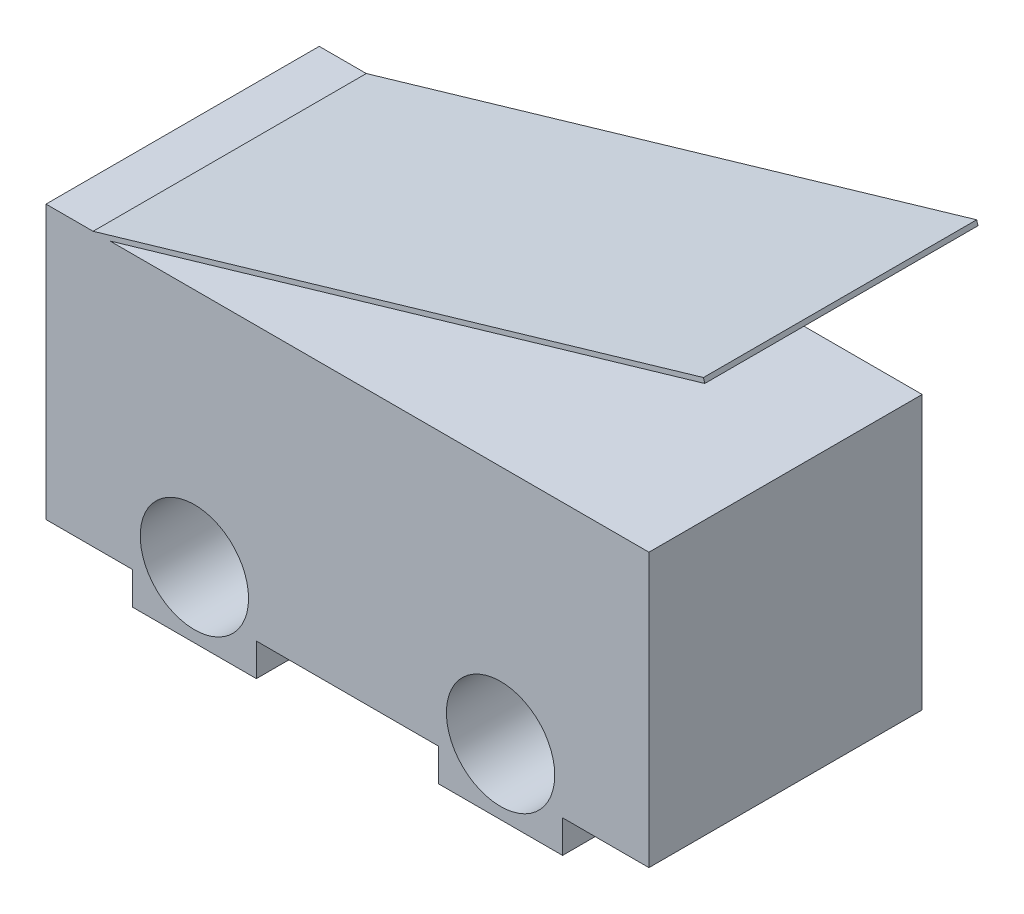
ISO-10303-21;
HEADER;
FILE_DESCRIPTION(('STEP AP214'),'2;1');
FILE_NAME('part.step','',(''),(''),'','','');
FILE_SCHEMA(('AUTOMOTIVE_DESIGN { 1 0 10303 214 1 1 1 1 }'));
ENDSEC;
DATA;
#1=APPLICATION_CONTEXT('core data for automotive mechanical design processes');
#2=APPLICATION_PROTOCOL_DEFINITION('international standard','automotive_design',2000,#1);
#3=PRODUCT_CONTEXT('',#1,'mechanical');
#4=PRODUCT('Part','Part','',(#3));
#5=PRODUCT_RELATED_PRODUCT_CATEGORY('part','',(#4));
#6=PRODUCT_DEFINITION_FORMATION('','',#4);
#7=PRODUCT_DEFINITION_CONTEXT('part definition',#1,'design');
#8=PRODUCT_DEFINITION('design','',#6,#7);
#9=PRODUCT_DEFINITION_SHAPE('','',#8);
#10=(LENGTH_UNIT() NAMED_UNIT(*) SI_UNIT(.MILLI.,.METRE.));
#11=(NAMED_UNIT(*) PLANE_ANGLE_UNIT() SI_UNIT($,.RADIAN.));
#12=(NAMED_UNIT(*) SI_UNIT($,.STERADIAN.) SOLID_ANGLE_UNIT());
#13=UNCERTAINTY_MEASURE_WITH_UNIT(LENGTH_MEASURE(1.E-05),#10,'distance_accuracy_value','');
#14=(GEOMETRIC_REPRESENTATION_CONTEXT(3) GLOBAL_UNCERTAINTY_ASSIGNED_CONTEXT((#13)) GLOBAL_UNIT_ASSIGNED_CONTEXT((#10,
#11,#12)) REPRESENTATION_CONTEXT('',''));
#15=CARTESIAN_POINT('',(0.,0.,0.));
#16=DIRECTION('',(0.,0.,1.));
#17=DIRECTION('',(1.,0.,0.));
#18=AXIS2_PLACEMENT_3D('',#15,#16,#17);
#19=CARTESIAN_POINT('',(6.4,2.9,-5.8));
#20=DIRECTION('',(0.,1.,0.));
#21=DIRECTION('',(-1.,0.,0.));
#22=AXIS2_PLACEMENT_3D('',#19,#20,#21);
#23=PLANE('',#22);
#24=DIRECTION('',(-1.,0.,0.));
#25=VECTOR('',#24,1.);
#26=CARTESIAN_POINT('',(6.4,2.9,0.));
#27=LINE('',#26,#25);
#28=CARTESIAN_POINT('',(-5.4,2.9,0.));
#29=VERTEX_POINT('',#28);
#30=CARTESIAN_POINT('',(-6.4,2.9,0.));
#31=VERTEX_POINT('',#30);
#32=EDGE_CURVE('E64',#29,#31,#27,.T.);
#33=ORIENTED_EDGE('',*,*,#32,.F.);
#34=DIRECTION('',(0.,0.,1.));
#35=VECTOR('',#34,1.);
#36=CARTESIAN_POINT('',(-5.4,2.9,-19.3541518362062));
#37=LINE('',#36,#35);
#38=CARTESIAN_POINT('',(-5.4,2.9,-5.8));
#39=VERTEX_POINT('',#38);
#40=EDGE_CURVE('E190',#39,#29,#37,.T.);
#41=ORIENTED_EDGE('',*,*,#40,.F.);
#42=DIRECTION('',(-1.,0.,0.));
#43=VECTOR('',#42,1.);
#44=CARTESIAN_POINT('',(6.4,2.9,-5.8));
#45=LINE('',#44,#43);
#46=CARTESIAN_POINT('',(-6.4,2.9,-5.8));
#47=VERTEX_POINT('',#46);
#48=EDGE_CURVE('E263',#39,#47,#45,.T.);
#49=ORIENTED_EDGE('',*,*,#48,.T.);
#50=DIRECTION('',(0.,0.,1.));
#51=VECTOR('',#50,1.);
#52=CARTESIAN_POINT('',(-6.4,2.9,-5.8));
#53=LINE('',#52,#51);
#54=EDGE_CURVE('E11',#47,#31,#53,.T.);
#55=ORIENTED_EDGE('',*,*,#54,.T.);
#56=EDGE_LOOP('',(#33,#41,#49,#55));
#57=FACE_BOUND('',#56,.T.);
#58=ADVANCED_FACE('F39',(#57),#23,.T.);
#59=CARTESIAN_POINT('',(-6.4,-2.9,-5.8));
#60=DIRECTION('',(-1.,0.,0.));
#61=DIRECTION('',(0.,0.,1.));
#62=AXIS2_PLACEMENT_3D('',#59,#60,#61);
#63=PLANE('',#62);
#64=DIRECTION('',(0.,-1.,0.));
#65=VECTOR('',#64,1.);
#66=CARTESIAN_POINT('',(-6.4,-2.9,0.));
#67=LINE('',#66,#65);
#68=CARTESIAN_POINT('',(-6.4,-2.9,0.));
#69=VERTEX_POINT('',#68);
#70=EDGE_CURVE('E215',#31,#69,#67,.T.);
#71=ORIENTED_EDGE('',*,*,#70,.F.);
#72=ORIENTED_EDGE('',*,*,#54,.F.);
#73=DIRECTION('',(0.,-1.,0.));
#74=VECTOR('',#73,1.);
#75=CARTESIAN_POINT('',(-6.4,-2.9,-5.8));
#76=LINE('',#75,#74);
#77=CARTESIAN_POINT('',(-6.4,-2.9,-5.8));
#78=VERTEX_POINT('',#77);
#79=EDGE_CURVE('E219',#47,#78,#76,.T.);
#80=ORIENTED_EDGE('',*,*,#79,.T.);
#81=DIRECTION('',(0.,0.,1.));
#82=VECTOR('',#81,1.);
#83=CARTESIAN_POINT('',(-6.4,-2.9,-5.8));
#84=LINE('',#83,#82);
#85=EDGE_CURVE('E43',#78,#69,#84,.T.);
#86=ORIENTED_EDGE('',*,*,#85,.T.);
#87=EDGE_LOOP('',(#71,#72,#80,#86));
#88=FACE_BOUND('',#87,.T.);
#89=ADVANCED_FACE('F41',(#88),#63,.T.);
#90=DIRECTION('',(0.,0.,-1.));
#91=VECTOR('',#90,1.);
#92=CARTESIAN_POINT('',(-5.04379947229552,2.9,-5.8));
#93=LINE('',#92,#91);
#94=CARTESIAN_POINT('',(-5.0437994722955,2.9,0.));
#95=VERTEX_POINT('',#94);
#96=CARTESIAN_POINT('',(-5.0437994722955,2.9,-5.8));
#97=VERTEX_POINT('',#96);
#98=EDGE_CURVE('E199',#95,#97,#93,.T.);
#99=ORIENTED_EDGE('',*,*,#98,.F.);
#100=CARTESIAN_POINT('',(6.4,2.9,0.));
#101=VERTEX_POINT('',#100);
#102=EDGE_CURVE('E165',#101,#95,#27,.T.);
#103=ORIENTED_EDGE('',*,*,#102,.F.);
#104=DIRECTION('',(0.,0.,1.));
#105=VECTOR('',#104,1.);
#106=CARTESIAN_POINT('',(6.4,2.9,-5.8));
#107=LINE('',#106,#105);
#108=CARTESIAN_POINT('',(6.4,2.9,-5.8));
#109=VERTEX_POINT('',#108);
#110=EDGE_CURVE('E49',#109,#101,#107,.T.);
#111=ORIENTED_EDGE('',*,*,#110,.F.);
#112=EDGE_CURVE('E57',#109,#97,#45,.T.);
#113=ORIENTED_EDGE('',*,*,#112,.T.);
#114=EDGE_LOOP('',(#99,#103,#111,#113));
#115=FACE_BOUND('',#114,.T.);
#116=ADVANCED_FACE('F386',(#115),#23,.T.);
#117=CARTESIAN_POINT('',(6.4,-2.9,-5.8));
#118=DIRECTION('',(1.,0.,0.));
#119=DIRECTION('',(0.,0.,-1.));
#120=AXIS2_PLACEMENT_3D('',#117,#118,#119);
#121=PLANE('',#120);
#122=DIRECTION('',(0.,1.,0.));
#123=VECTOR('',#122,1.);
#124=CARTESIAN_POINT('',(6.4,-2.9,0.));
#125=LINE('',#124,#123);
#126=CARTESIAN_POINT('',(6.4,-2.9,0.));
#127=VERTEX_POINT('',#126);
#128=EDGE_CURVE('E305',#127,#101,#125,.T.);
#129=ORIENTED_EDGE('',*,*,#128,.F.);
#130=DIRECTION('',(0.,0.,1.));
#131=VECTOR('',#130,1.);
#132=CARTESIAN_POINT('',(6.4,-2.9,-5.8));
#133=LINE('',#132,#131);
#134=CARTESIAN_POINT('',(6.4,-2.9,-5.8));
#135=VERTEX_POINT('',#134);
#136=EDGE_CURVE('E312',#135,#127,#133,.T.);
#137=ORIENTED_EDGE('',*,*,#136,.F.);
#138=DIRECTION('',(0.,1.,0.));
#139=VECTOR('',#138,1.);
#140=CARTESIAN_POINT('',(6.4,-2.9,-5.8));
#141=LINE('',#140,#139);
#142=EDGE_CURVE('E259',#135,#109,#141,.T.);
#143=ORIENTED_EDGE('',*,*,#142,.T.);
#144=ORIENTED_EDGE('',*,*,#110,.T.);
#145=EDGE_LOOP('',(#129,#137,#143,#144));
#146=FACE_BOUND('',#145,.T.);
#147=ADVANCED_FACE('F385',(#146),#121,.T.);
#148=CARTESIAN_POINT('',(4.56583824460717,-2.9,-5.8));
#149=DIRECTION('',(0.,-1.,0.));
#150=DIRECTION('',(1.,0.,0.));
#151=AXIS2_PLACEMENT_3D('',#148,#149,#150);
#152=PLANE('',#151);
#153=DIRECTION('',(1.,0.,0.));
#154=VECTOR('',#153,1.);
#155=CARTESIAN_POINT('',(4.56583824460717,-2.9,0.));
#156=LINE('',#155,#154);
#157=CARTESIAN_POINT('',(4.56583824460717,-2.9,0.));
#158=VERTEX_POINT('',#157);
#159=EDGE_CURVE('E301',#158,#127,#156,.T.);
#160=ORIENTED_EDGE('',*,*,#159,.F.);
#161=DIRECTION('',(0.,0.,1.));
#162=VECTOR('',#161,1.);
#163=CARTESIAN_POINT('',(4.56583824460717,-2.9,-5.8));
#164=LINE('',#163,#162);
#165=CARTESIAN_POINT('',(4.56583824460717,-2.9,-5.8));
#166=VERTEX_POINT('',#165);
#167=EDGE_CURVE('E315',#166,#158,#164,.T.);
#168=ORIENTED_EDGE('',*,*,#167,.F.);
#169=DIRECTION('',(1.,0.,0.));
#170=VECTOR('',#169,1.);
#171=CARTESIAN_POINT('',(4.56583824460717,-2.9,-5.8));
#172=LINE('',#171,#170);
#173=EDGE_CURVE('E255',#166,#135,#172,.T.);
#174=ORIENTED_EDGE('',*,*,#173,.T.);
#175=ORIENTED_EDGE('',*,*,#136,.T.);
#176=EDGE_LOOP('',(#160,#168,#174,#175));
#177=FACE_BOUND('',#176,.T.);
#178=ADVANCED_FACE('F381',(#177),#152,.T.);
#179=CARTESIAN_POINT('',(4.56583824460717,-3.5923412014627,-5.8));
#180=DIRECTION('',(1.,0.,0.));
#181=DIRECTION('',(0.,0.,-1.));
#182=AXIS2_PLACEMENT_3D('',#179,#180,#181);
#183=PLANE('',#182);
#184=DIRECTION('',(0.,1.,0.));
#185=VECTOR('',#184,1.);
#186=CARTESIAN_POINT('',(4.56583824460717,-3.5923412014627,0.));
#187=LINE('',#186,#185);
#188=CARTESIAN_POINT('',(4.56583824460717,-3.5923412014627,0.));
#189=VERTEX_POINT('',#188);
#190=EDGE_CURVE('E297',#189,#158,#187,.T.);
#191=ORIENTED_EDGE('',*,*,#190,.F.);
#192=DIRECTION('',(0.,0.,1.));
#193=VECTOR('',#192,1.);
#194=CARTESIAN_POINT('',(4.56583824460717,-3.5923412014627,-5.8));
#195=LINE('',#194,#193);
#196=CARTESIAN_POINT('',(4.56583824460717,-3.5923412014627,-5.8));
#197=VERTEX_POINT('',#196);
#198=EDGE_CURVE('E318',#197,#189,#195,.T.);
#199=ORIENTED_EDGE('',*,*,#198,.F.);
#200=DIRECTION('',(0.,1.,0.));
#201=VECTOR('',#200,1.);
#202=CARTESIAN_POINT('',(4.56583824460717,-3.5923412014627,-5.8));
#203=LINE('',#202,#201);
#204=EDGE_CURVE('E251',#197,#166,#203,.T.);
#205=ORIENTED_EDGE('',*,*,#204,.T.);
#206=ORIENTED_EDGE('',*,*,#167,.T.);
#207=EDGE_LOOP('',(#191,#199,#205,#206));
#208=FACE_BOUND('',#207,.T.);
#209=ADVANCED_FACE('F377',(#208),#183,.T.);
#210=CARTESIAN_POINT('',(1.93416175539283,-3.5923412014627,-5.8));
#211=DIRECTION('',(0.,-1.,0.));
#212=DIRECTION('',(0.,0.,-1.));
#213=AXIS2_PLACEMENT_3D('',#210,#211,#212);
#214=PLANE('',#213);
#215=DIRECTION('',(1.,0.,0.));
#216=VECTOR('',#215,1.);
#217=CARTESIAN_POINT('',(1.93416175539283,-3.5923412014627,0.));
#218=LINE('',#217,#216);
#219=CARTESIAN_POINT('',(1.93416175539283,-3.5923412014627,0.));
#220=VERTEX_POINT('',#219);
#221=EDGE_CURVE('E293',#220,#189,#218,.T.);
#222=ORIENTED_EDGE('',*,*,#221,.F.);
#223=DIRECTION('',(0.,0.,1.));
#224=VECTOR('',#223,1.);
#225=CARTESIAN_POINT('',(1.93416175539283,-3.5923412014627,-5.8));
#226=LINE('',#225,#224);
#227=CARTESIAN_POINT('',(1.93416175539283,-3.5923412014627,-5.8));
#228=VERTEX_POINT('',#227);
#229=EDGE_CURVE('E321',#228,#220,#226,.T.);
#230=ORIENTED_EDGE('',*,*,#229,.F.);
#231=DIRECTION('',(1.,0.,0.));
#232=VECTOR('',#231,1.);
#233=CARTESIAN_POINT('',(1.93416175539283,-3.5923412014627,-5.8));
#234=LINE('',#233,#232);
#235=EDGE_CURVE('E247',#228,#197,#234,.T.);
#236=ORIENTED_EDGE('',*,*,#235,.T.);
#237=ORIENTED_EDGE('',*,*,#198,.T.);
#238=EDGE_LOOP('',(#222,#230,#236,#237));
#239=FACE_BOUND('',#238,.T.);
#240=ADVANCED_FACE('F373',(#239),#214,.T.);
#241=CARTESIAN_POINT('',(1.93416175539283,-2.9,-5.8));
#242=DIRECTION('',(-1.,0.,0.));
#243=DIRECTION('',(0.,0.,1.));
#244=AXIS2_PLACEMENT_3D('',#241,#242,#243);
#245=PLANE('',#244);
#246=DIRECTION('',(0.,-1.,0.));
#247=VECTOR('',#246,1.);
#248=CARTESIAN_POINT('',(1.93416175539283,-2.9,0.));
#249=LINE('',#248,#247);
#250=CARTESIAN_POINT('',(1.93416175539283,-2.9,0.));
#251=VERTEX_POINT('',#250);
#252=EDGE_CURVE('E289',#251,#220,#249,.T.);
#253=ORIENTED_EDGE('',*,*,#252,.F.);
#254=DIRECTION('',(0.,0.,1.));
#255=VECTOR('',#254,1.);
#256=CARTESIAN_POINT('',(1.93416175539283,-2.9,-5.8));
#257=LINE('',#256,#255);
#258=CARTESIAN_POINT('',(1.93416175539283,-2.9,-5.8));
#259=VERTEX_POINT('',#258);
#260=EDGE_CURVE('E324',#259,#251,#257,.T.);
#261=ORIENTED_EDGE('',*,*,#260,.F.);
#262=DIRECTION('',(0.,-1.,0.));
#263=VECTOR('',#262,1.);
#264=CARTESIAN_POINT('',(1.93416175539283,-2.9,-5.8));
#265=LINE('',#264,#263);
#266=EDGE_CURVE('E243',#259,#228,#265,.T.);
#267=ORIENTED_EDGE('',*,*,#266,.T.);
#268=ORIENTED_EDGE('',*,*,#229,.T.);
#269=EDGE_LOOP('',(#253,#261,#267,#268));
#270=FACE_BOUND('',#269,.T.);
#271=ADVANCED_FACE('F369',(#270),#245,.T.);
#272=CARTESIAN_POINT('',(-1.93416175539283,-2.9,-5.8));
#273=DIRECTION('',(0.,-1.,0.));
#274=DIRECTION('',(0.,0.,-1.));
#275=AXIS2_PLACEMENT_3D('',#272,#273,#274);
#276=PLANE('',#275);
#277=DIRECTION('',(1.,0.,0.));
#278=VECTOR('',#277,1.);
#279=CARTESIAN_POINT('',(-1.93416175539283,-2.9,0.));
#280=LINE('',#279,#278);
#281=CARTESIAN_POINT('',(-1.93416175539283,-2.9,0.));
#282=VERTEX_POINT('',#281);
#283=EDGE_CURVE('E285',#282,#251,#280,.T.);
#284=ORIENTED_EDGE('',*,*,#283,.F.);
#285=DIRECTION('',(0.,0.,1.));
#286=VECTOR('',#285,1.);
#287=CARTESIAN_POINT('',(-1.93416175539283,-2.9,-5.8));
#288=LINE('',#287,#286);
#289=CARTESIAN_POINT('',(-1.93416175539283,-2.9,-5.8));
#290=VERTEX_POINT('',#289);
#291=EDGE_CURVE('E327',#290,#282,#288,.T.);
#292=ORIENTED_EDGE('',*,*,#291,.F.);
#293=DIRECTION('',(1.,0.,0.));
#294=VECTOR('',#293,1.);
#295=CARTESIAN_POINT('',(-1.93416175539283,-2.9,-5.8));
#296=LINE('',#295,#294);
#297=EDGE_CURVE('E239',#290,#259,#296,.T.);
#298=ORIENTED_EDGE('',*,*,#297,.T.);
#299=ORIENTED_EDGE('',*,*,#260,.T.);
#300=EDGE_LOOP('',(#284,#292,#298,#299));
#301=FACE_BOUND('',#300,.T.);
#302=ADVANCED_FACE('F365',(#301),#276,.T.);
#303=CARTESIAN_POINT('',(-1.93416175539283,-3.5923412014627,-5.8));
#304=DIRECTION('',(1.,0.,0.));
#305=DIRECTION('',(0.,0.,-1.));
#306=AXIS2_PLACEMENT_3D('',#303,#304,#305);
#307=PLANE('',#306);
#308=DIRECTION('',(0.,1.,0.));
#309=VECTOR('',#308,1.);
#310=CARTESIAN_POINT('',(-1.93416175539283,-3.5923412014627,0.));
#311=LINE('',#310,#309);
#312=CARTESIAN_POINT('',(-1.93416175539283,-3.5923412014627,0.));
#313=VERTEX_POINT('',#312);
#314=EDGE_CURVE('E281',#313,#282,#311,.T.);
#315=ORIENTED_EDGE('',*,*,#314,.F.);
#316=DIRECTION('',(0.,0.,1.));
#317=VECTOR('',#316,1.);
#318=CARTESIAN_POINT('',(-1.93416175539283,-3.5923412014627,-5.8));
#319=LINE('',#318,#317);
#320=CARTESIAN_POINT('',(-1.93416175539283,-3.5923412014627,-5.8));
#321=VERTEX_POINT('',#320);
#322=EDGE_CURVE('E330',#321,#313,#319,.T.);
#323=ORIENTED_EDGE('',*,*,#322,.F.);
#324=DIRECTION('',(0.,1.,0.));
#325=VECTOR('',#324,1.);
#326=CARTESIAN_POINT('',(-1.93416175539283,-3.5923412014627,-5.8));
#327=LINE('',#326,#325);
#328=EDGE_CURVE('E235',#321,#290,#327,.T.);
#329=ORIENTED_EDGE('',*,*,#328,.T.);
#330=ORIENTED_EDGE('',*,*,#291,.T.);
#331=EDGE_LOOP('',(#315,#323,#329,#330));
#332=FACE_BOUND('',#331,.T.);
#333=ADVANCED_FACE('F361',(#332),#307,.T.);
#334=CARTESIAN_POINT('',(-4.56583824460717,-3.5923412014627,-5.8));
#335=DIRECTION('',(0.,-1.,0.));
#336=DIRECTION('',(0.,0.,-1.));
#337=AXIS2_PLACEMENT_3D('',#334,#335,#336);
#338=PLANE('',#337);
#339=DIRECTION('',(1.,0.,0.));
#340=VECTOR('',#339,1.);
#341=CARTESIAN_POINT('',(-4.56583824460717,-3.5923412014627,0.));
#342=LINE('',#341,#340);
#343=CARTESIAN_POINT('',(-4.56583824460717,-3.5923412014627,0.));
#344=VERTEX_POINT('',#343);
#345=EDGE_CURVE('E277',#344,#313,#342,.T.);
#346=ORIENTED_EDGE('',*,*,#345,.F.);
#347=DIRECTION('',(0.,0.,1.));
#348=VECTOR('',#347,1.);
#349=CARTESIAN_POINT('',(-4.56583824460717,-3.5923412014627,-5.8));
#350=LINE('',#349,#348);
#351=CARTESIAN_POINT('',(-4.56583824460717,-3.5923412014627,-5.8));
#352=VERTEX_POINT('',#351);
#353=EDGE_CURVE('E333',#352,#344,#350,.T.);
#354=ORIENTED_EDGE('',*,*,#353,.F.);
#355=DIRECTION('',(1.,0.,0.));
#356=VECTOR('',#355,1.);
#357=CARTESIAN_POINT('',(-4.56583824460717,-3.5923412014627,-5.8));
#358=LINE('',#357,#356);
#359=EDGE_CURVE('E231',#352,#321,#358,.T.);
#360=ORIENTED_EDGE('',*,*,#359,.T.);
#361=ORIENTED_EDGE('',*,*,#322,.T.);
#362=EDGE_LOOP('',(#346,#354,#360,#361));
#363=FACE_BOUND('',#362,.T.);
#364=ADVANCED_FACE('F359',(#363),#338,.T.);
#365=CARTESIAN_POINT('',(-4.56583824460717,-2.9,-5.8));
#366=DIRECTION('',(-1.,0.,0.));
#367=DIRECTION('',(0.,0.,1.));
#368=AXIS2_PLACEMENT_3D('',#365,#366,#367);
#369=PLANE('',#368);
#370=DIRECTION('',(0.,-1.,0.));
#371=VECTOR('',#370,1.);
#372=CARTESIAN_POINT('',(-4.56583824460717,-2.9,0.));
#373=LINE('',#372,#371);
#374=CARTESIAN_POINT('',(-4.56583824460717,-2.9,0.));
#375=VERTEX_POINT('',#374);
#376=EDGE_CURVE('E273',#375,#344,#373,.T.);
#377=ORIENTED_EDGE('',*,*,#376,.F.);
#378=DIRECTION('',(0.,0.,1.));
#379=VECTOR('',#378,1.);
#380=CARTESIAN_POINT('',(-4.56583824460717,-2.9,-5.8));
#381=LINE('',#380,#379);
#382=CARTESIAN_POINT('',(-4.56583824460717,-2.9,-5.8));
#383=VERTEX_POINT('',#382);
#384=EDGE_CURVE('E335',#383,#375,#381,.T.);
#385=ORIENTED_EDGE('',*,*,#384,.F.);
#386=DIRECTION('',(0.,-1.,0.));
#387=VECTOR('',#386,1.);
#388=CARTESIAN_POINT('',(-4.56583824460717,-2.9,-5.8));
#389=LINE('',#388,#387);
#390=EDGE_CURVE('E227',#383,#352,#389,.T.);
#391=ORIENTED_EDGE('',*,*,#390,.T.);
#392=ORIENTED_EDGE('',*,*,#353,.T.);
#393=EDGE_LOOP('',(#377,#385,#391,#392));
#394=FACE_BOUND('',#393,.T.);
#395=ADVANCED_FACE('F355',(#394),#369,.T.);
#396=CARTESIAN_POINT('',(-6.4,-2.9,-5.8));
#397=DIRECTION('',(0.,-1.,0.));
#398=DIRECTION('',(1.,0.,0.));
#399=AXIS2_PLACEMENT_3D('',#396,#397,#398);
#400=PLANE('',#399);
#401=DIRECTION('',(1.,0.,0.));
#402=VECTOR('',#401,1.);
#403=CARTESIAN_POINT('',(-6.4,-2.9,0.));
#404=LINE('',#403,#402);
#405=EDGE_CURVE('E269',#69,#375,#404,.T.);
#406=ORIENTED_EDGE('',*,*,#405,.F.);
#407=ORIENTED_EDGE('',*,*,#85,.F.);
#408=DIRECTION('',(1.,0.,0.));
#409=VECTOR('',#408,1.);
#410=CARTESIAN_POINT('',(-6.4,-2.9,-5.8));
#411=LINE('',#410,#409);
#412=EDGE_CURVE('E223',#78,#383,#411,.T.);
#413=ORIENTED_EDGE('',*,*,#412,.T.);
#414=ORIENTED_EDGE('',*,*,#384,.T.);
#415=EDGE_LOOP('',(#406,#407,#413,#414));
#416=FACE_BOUND('',#415,.T.);
#417=ADVANCED_FACE('F346',(#416),#400,.T.);
#418=CARTESIAN_POINT('',(0.,0.,-5.8));
#419=DIRECTION('',(0.,0.,1.));
#420=DIRECTION('',(1.,0.,0.));
#421=AXIS2_PLACEMENT_3D('',#418,#419,#420);
#422=PLANE('',#421);
#423=ORIENTED_EDGE('',*,*,#48,.F.);
#424=DIRECTION('',(-0.959783640456713,-0.280740740740741,0.));
#425=VECTOR('',#424,1.);
#426=CARTESIAN_POINT('',(-5.4,2.9,-5.8));
#427=LINE('',#426,#425);
#428=CARTESIAN_POINT('',(7.55707914616562,6.69,-5.8));
#429=VERTEX_POINT('',#428);
#430=EDGE_CURVE('E198',#429,#39,#427,.T.);
#431=ORIENTED_EDGE('',*,*,#430,.F.);
#432=DIRECTION('',(-0.280740740740791,0.959783640456698,0.));
#433=VECTOR('',#432,1.);
#434=CARTESIAN_POINT('',(7.55707914616562,6.69,-5.8));
#435=LINE('',#434,#433);
#436=CARTESIAN_POINT('',(7.5851532202397,6.59402163595433,-5.8));
#437=VERTEX_POINT('',#436);
#438=EDGE_CURVE('E193',#437,#429,#435,.T.);
#439=ORIENTED_EDGE('',*,*,#438,.F.);
#440=DIRECTION('',(-0.959783640456713,-0.280740740740741,0.));
#441=VECTOR('',#440,1.);
#442=CARTESIAN_POINT('',(-5.37192592592593,2.80402163595433,-5.8));
#443=LINE('',#442,#441);
#444=EDGE_CURVE('E174',#437,#97,#443,.T.);
#445=ORIENTED_EDGE('',*,*,#444,.T.);
#446=ORIENTED_EDGE('',*,*,#112,.F.);
#447=ORIENTED_EDGE('',*,*,#142,.F.);
#448=ORIENTED_EDGE('',*,*,#173,.F.);
#449=ORIENTED_EDGE('',*,*,#204,.F.);
#450=ORIENTED_EDGE('',*,*,#235,.F.);
#451=ORIENTED_EDGE('',*,*,#266,.F.);
#452=ORIENTED_EDGE('',*,*,#297,.F.);
#453=ORIENTED_EDGE('',*,*,#328,.F.);
#454=ORIENTED_EDGE('',*,*,#359,.F.);
#455=ORIENTED_EDGE('',*,*,#390,.F.);
#456=ORIENTED_EDGE('',*,*,#412,.F.);
#457=ORIENTED_EDGE('',*,*,#79,.F.);
#458=EDGE_LOOP('',(#423,#431,#439,#445,#446,#447,#448,#449,#450,#451,#452,#453,#454,#455,#456,#457));
#459=FACE_BOUND('',#458,.T.);
#460=CARTESIAN_POINT('',(-3.25,-2.2,-5.8));
#461=DIRECTION('',(0.,0.,1.));
#462=DIRECTION('',(1.,0.,0.));
#463=AXIS2_PLACEMENT_3D('',#460,#461,#462);
#464=CIRCLE('',#463,1.15);
#465=CARTESIAN_POINT('',(-2.1,-2.2,-5.8));
#466=VERTEX_POINT('',#465);
#467=EDGE_CURVE('E211',#466,#466,#464,.T.);
#468=ORIENTED_EDGE('',*,*,#467,.T.);
#469=EDGE_LOOP('',(#468));
#470=FACE_BOUND('',#469,.T.);
#471=CARTESIAN_POINT('',(3.25,-2.2,-5.8));
#472=DIRECTION('',(0.,0.,1.));
#473=DIRECTION('',(1.,0.,0.));
#474=AXIS2_PLACEMENT_3D('',#471,#472,#473);
#475=CIRCLE('',#474,1.15);
#476=CARTESIAN_POINT('',(4.4,-2.2,-5.8));
#477=VERTEX_POINT('',#476);
#478=EDGE_CURVE('E203',#477,#477,#475,.T.);
#479=ORIENTED_EDGE('',*,*,#478,.T.);
#480=EDGE_LOOP('',(#479));
#481=FACE_BOUND('',#480,.T.);
#482=ADVANCED_FACE('F349',(#459,#470,#481),#422,.F.);
#483=CARTESIAN_POINT('',(0.,0.,0.));
#484=DIRECTION('',(0.,0.,1.));
#485=DIRECTION('',(1.,0.,0.));
#486=AXIS2_PLACEMENT_3D('',#483,#484,#485);
#487=PLANE('',#486);
#488=ORIENTED_EDGE('',*,*,#102,.T.);
#489=DIRECTION('',(0.959783640456713,0.280740740740741,0.));
#490=VECTOR('',#489,1.);
#491=CARTESIAN_POINT('',(-5.37192592592593,2.80402163595433,0.));
#492=LINE('',#491,#490);
#493=CARTESIAN_POINT('',(7.5851532202397,6.59402163595433,0.));
#494=VERTEX_POINT('',#493);
#495=EDGE_CURVE('E156',#95,#494,#492,.T.);
#496=ORIENTED_EDGE('',*,*,#495,.T.);
#497=DIRECTION('',(0.280740740740791,-0.959783640456698,0.));
#498=VECTOR('',#497,1.);
#499=CARTESIAN_POINT('',(7.55707914616562,6.69,0.));
#500=LINE('',#499,#498);
#501=CARTESIAN_POINT('',(7.55707914616562,6.69,0.));
#502=VERTEX_POINT('',#501);
#503=EDGE_CURVE('E162',#502,#494,#500,.T.);
#504=ORIENTED_EDGE('',*,*,#503,.F.);
#505=DIRECTION('',(0.959783640456712,0.280740740740741,0.));
#506=VECTOR('',#505,1.);
#507=CARTESIAN_POINT('',(-5.4,2.9,0.));
#508=LINE('',#507,#506);
#509=EDGE_CURVE('E179',#29,#502,#508,.T.);
#510=ORIENTED_EDGE('',*,*,#509,.F.);
#511=ORIENTED_EDGE('',*,*,#32,.T.);
#512=ORIENTED_EDGE('',*,*,#70,.T.);
#513=ORIENTED_EDGE('',*,*,#405,.T.);
#514=ORIENTED_EDGE('',*,*,#376,.T.);
#515=ORIENTED_EDGE('',*,*,#345,.T.);
#516=ORIENTED_EDGE('',*,*,#314,.T.);
#517=ORIENTED_EDGE('',*,*,#283,.T.);
#518=ORIENTED_EDGE('',*,*,#252,.T.);
#519=ORIENTED_EDGE('',*,*,#221,.T.);
#520=ORIENTED_EDGE('',*,*,#190,.T.);
#521=ORIENTED_EDGE('',*,*,#159,.T.);
#522=ORIENTED_EDGE('',*,*,#128,.T.);
#523=EDGE_LOOP('',(#488,#496,#504,#510,#511,#512,#513,#514,#515,#516,#517,#518,#519,#520,#521,#522));
#524=FACE_BOUND('',#523,.T.);
#525=CARTESIAN_POINT('',(3.25,-2.2,0.));
#526=DIRECTION('',(0.,0.,1.));
#527=DIRECTION('',(1.,0.,0.));
#528=AXIS2_PLACEMENT_3D('',#525,#526,#527);
#529=CIRCLE('',#528,1.15);
#530=CARTESIAN_POINT('',(4.4,-2.2,0.));
#531=VERTEX_POINT('',#530);
#532=EDGE_CURVE('E202',#531,#531,#529,.T.);
#533=ORIENTED_EDGE('',*,*,#532,.F.);
#534=EDGE_LOOP('',(#533));
#535=FACE_BOUND('',#534,.T.);
#536=CARTESIAN_POINT('',(-3.25,-2.2,0.));
#537=DIRECTION('',(0.,0.,1.));
#538=DIRECTION('',(1.,0.,0.));
#539=AXIS2_PLACEMENT_3D('',#536,#537,#538);
#540=CIRCLE('',#539,1.15);
#541=CARTESIAN_POINT('',(-2.1,-2.2,0.));
#542=VERTEX_POINT('',#541);
#543=EDGE_CURVE('E207',#542,#542,#540,.T.);
#544=ORIENTED_EDGE('',*,*,#543,.F.);
#545=EDGE_LOOP('',(#544));
#546=FACE_BOUND('',#545,.T.);
#547=ADVANCED_FACE('F158',(#524,#535,#546),#487,.T.);
#548=CARTESIAN_POINT('',(-3.25,-2.2,-5.8));
#549=DIRECTION('',(0.,0.,1.));
#550=DIRECTION('',(1.,0.,0.));
#551=AXIS2_PLACEMENT_3D('',#548,#549,#550);
#552=CYLINDRICAL_SURFACE('',#551,1.15);
#553=ORIENTED_EDGE('',*,*,#467,.F.);
#554=EDGE_LOOP('',(#553));
#555=FACE_BOUND('',#554,.T.);
#556=ORIENTED_EDGE('',*,*,#543,.T.);
#557=EDGE_LOOP('',(#556));
#558=FACE_BOUND('',#557,.T.);
#559=ADVANCED_FACE('F441',(#555,#558),#552,.F.);
#560=CARTESIAN_POINT('',(3.25,-2.2,-5.8));
#561=DIRECTION('',(0.,0.,1.));
#562=DIRECTION('',(1.,0.,0.));
#563=AXIS2_PLACEMENT_3D('',#560,#561,#562);
#564=CYLINDRICAL_SURFACE('',#563,1.15);
#565=ORIENTED_EDGE('',*,*,#478,.F.);
#566=EDGE_LOOP('',(#565));
#567=FACE_BOUND('',#566,.T.);
#568=ORIENTED_EDGE('',*,*,#532,.T.);
#569=EDGE_LOOP('',(#568));
#570=FACE_BOUND('',#569,.T.);
#571=ADVANCED_FACE('F400',(#567,#570),#564,.F.);
#572=CARTESIAN_POINT('',(7.55707914616562,6.69,-19.3541518362062));
#573=DIRECTION('',(-0.959783640456698,-0.280740740740791,0.));
#574=DIRECTION('',(0.280740740740791,-0.959783640456698,0.));
#575=AXIS2_PLACEMENT_3D('',#572,#573,#574);
#576=PLANE('',#575);
#577=DIRECTION('',(0.,0.,1.));
#578=VECTOR('',#577,1.);
#579=CARTESIAN_POINT('',(7.5851532202397,6.59402163595433,-19.3541518362062));
#580=LINE('',#579,#578);
#581=EDGE_CURVE('E171',#437,#494,#580,.T.);
#582=ORIENTED_EDGE('',*,*,#581,.F.);
#583=ORIENTED_EDGE('',*,*,#438,.T.);
#584=DIRECTION('',(0.,0.,1.));
#585=VECTOR('',#584,1.);
#586=CARTESIAN_POINT('',(7.55707914616562,6.69,-19.3541518362062));
#587=LINE('',#586,#585);
#588=EDGE_CURVE('E178',#429,#502,#587,.T.);
#589=ORIENTED_EDGE('',*,*,#588,.T.);
#590=ORIENTED_EDGE('',*,*,#503,.T.);
#591=EDGE_LOOP('',(#582,#583,#589,#590));
#592=FACE_BOUND('',#591,.T.);
#593=ADVANCED_FACE('F181',(#592),#576,.F.);
#594=CARTESIAN_POINT('',(-5.4,2.9,-19.3541518362062));
#595=DIRECTION('',(0.280740740740741,-0.959783640456713,0.));
#596=DIRECTION('',(0.959783640456713,0.280740740740741,0.));
#597=AXIS2_PLACEMENT_3D('',#594,#595,#596);
#598=PLANE('',#597);
#599=ORIENTED_EDGE('',*,*,#588,.F.);
#600=ORIENTED_EDGE('',*,*,#430,.T.);
#601=ORIENTED_EDGE('',*,*,#40,.T.);
#602=ORIENTED_EDGE('',*,*,#509,.T.);
#603=EDGE_LOOP('',(#599,#600,#601,#602));
#604=FACE_BOUND('',#603,.T.);
#605=ADVANCED_FACE('F392',(#604),#598,.F.);
#606=CARTESIAN_POINT('',(-5.37192592592593,2.80402163595433,-19.3541518362062));
#607=DIRECTION('',(0.280740740740741,-0.959783640456713,0.));
#608=DIRECTION('',(0.959783640456713,0.280740740740741,0.));
#609=AXIS2_PLACEMENT_3D('',#606,#607,#608);
#610=PLANE('',#609);
#611=ORIENTED_EDGE('',*,*,#495,.F.);
#612=ORIENTED_EDGE('',*,*,#98,.T.);
#613=ORIENTED_EDGE('',*,*,#444,.F.);
#614=ORIENTED_EDGE('',*,*,#581,.T.);
#615=EDGE_LOOP('',(#611,#612,#613,#614));
#616=FACE_BOUND('',#615,.T.);
#617=ADVANCED_FACE('F172',(#616),#610,.T.);
#618=CLOSED_SHELL('',(#58,#89,#116,#147,#178,#209,#240,#271,#302,#333,#364,#395,#417,#482,#547,
#559,#571,#593,#605,#617));
#619=MANIFOLD_SOLID_BREP('B2',#618);
#620=ADVANCED_BREP_SHAPE_REPRESENTATION('',(#18,#619),#14);
#621=SHAPE_DEFINITION_REPRESENTATION(#9,#620);
ENDSEC;
END-ISO-10303-21;
